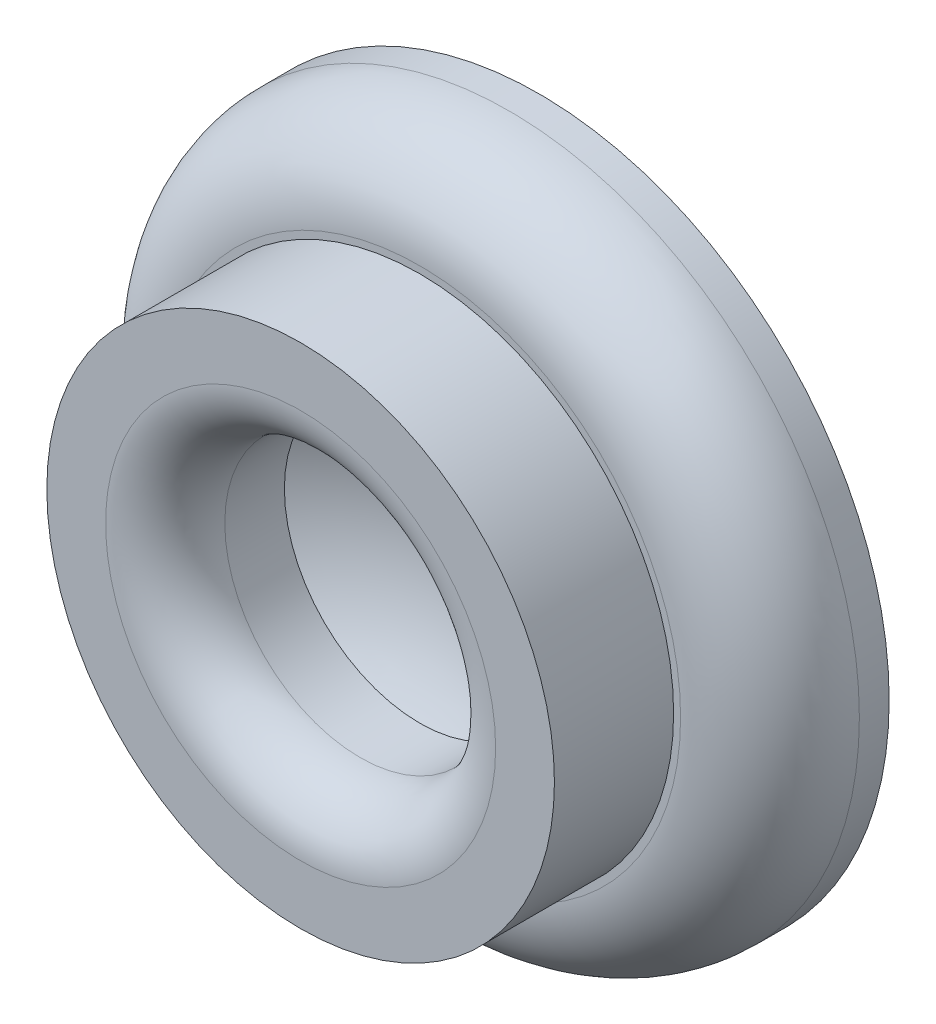
ISO-10303-21;
HEADER;
FILE_DESCRIPTION(('STEP AP214'),'2;1');
FILE_NAME('part.step','',(''),(''),'','','');
FILE_SCHEMA(('AUTOMOTIVE_DESIGN { 1 0 10303 214 1 1 1 1 }'));
ENDSEC;
DATA;
#1=APPLICATION_CONTEXT('core data for automotive mechanical design processes');
#2=APPLICATION_PROTOCOL_DEFINITION('international standard','automotive_design',2000,#1);
#3=PRODUCT_CONTEXT('',#1,'mechanical');
#4=PRODUCT('Part','Part','',(#3));
#5=PRODUCT_RELATED_PRODUCT_CATEGORY('part','',(#4));
#6=PRODUCT_DEFINITION_FORMATION('','',#4);
#7=PRODUCT_DEFINITION_CONTEXT('part definition',#1,'design');
#8=PRODUCT_DEFINITION('design','',#6,#7);
#9=PRODUCT_DEFINITION_SHAPE('','',#8);
#10=(LENGTH_UNIT() NAMED_UNIT(*) SI_UNIT(.MILLI.,.METRE.));
#11=(NAMED_UNIT(*) PLANE_ANGLE_UNIT() SI_UNIT($,.RADIAN.));
#12=(NAMED_UNIT(*) SI_UNIT($,.STERADIAN.) SOLID_ANGLE_UNIT());
#13=UNCERTAINTY_MEASURE_WITH_UNIT(LENGTH_MEASURE(1.E-05),#10,'distance_accuracy_value','');
#14=(GEOMETRIC_REPRESENTATION_CONTEXT(3) GLOBAL_UNCERTAINTY_ASSIGNED_CONTEXT((#13)) GLOBAL_UNIT_ASSIGNED_CONTEXT((#10,
#11,#12)) REPRESENTATION_CONTEXT('',''));
#15=CARTESIAN_POINT('',(0.,0.,0.));
#16=DIRECTION('',(0.,0.,1.));
#17=DIRECTION('',(1.,0.,0.));
#18=AXIS2_PLACEMENT_3D('',#15,#16,#17);
#19=CARTESIAN_POINT('',(0.,0.,6.));
#20=DIRECTION('',(0.,0.,1.));
#21=DIRECTION('',(1.,0.,0.));
#22=AXIS2_PLACEMENT_3D('',#19,#20,#21);
#23=PLANE('',#22);
#24=CARTESIAN_POINT('',(0.,0.,6.));
#25=DIRECTION('',(0.,0.,1.));
#26=DIRECTION('',(1.,0.,0.));
#27=AXIS2_PLACEMENT_3D('',#24,#25,#26);
#28=CIRCLE('',#27,13.1289984889152);
#29=CARTESIAN_POINT('',(13.1289984889152,0.,6.));
#30=VERTEX_POINT('',#29);
#31=EDGE_CURVE('E50',#30,#30,#28,.T.);
#32=ORIENTED_EDGE('',*,*,#31,.T.);
#33=EDGE_LOOP('',(#32));
#34=FACE_BOUND('',#33,.T.);
#35=CARTESIAN_POINT('',(0.,0.,6.));
#36=DIRECTION('',(0.,0.,1.));
#37=DIRECTION('',(1.,0.,0.));
#38=AXIS2_PLACEMENT_3D('',#35,#36,#37);
#39=CIRCLE('',#38,12.777406611752);
#40=CARTESIAN_POINT('',(12.777406611752,0.,6.));
#41=VERTEX_POINT('',#40);
#42=EDGE_CURVE('E57',#41,#41,#39,.T.);
#43=ORIENTED_EDGE('',*,*,#42,.F.);
#44=EDGE_LOOP('',(#43));
#45=FACE_BOUND('',#44,.T.);
#46=ADVANCED_FACE('F33',(#34,#45),#23,.T.);
#47=CARTESIAN_POINT('',(0.,0.,6.));
#48=DIRECTION('',(0.,0.,-1.));
#49=DIRECTION('',(-1.,0.,0.));
#50=AXIS2_PLACEMENT_3D('',#47,#48,#49);
#51=CYLINDRICAL_SURFACE('',#50,17.6289984889152);
#52=CARTESIAN_POINT('',(0.,0.,1.5));
#53=DIRECTION('',(0.,0.,1.));
#54=DIRECTION('',(1.,0.,0.));
#55=AXIS2_PLACEMENT_3D('',#52,#53,#54);
#56=CIRCLE('',#55,17.6289984889152);
#57=CARTESIAN_POINT('',(17.6289984889152,0.,1.5));
#58=VERTEX_POINT('',#57);
#59=EDGE_CURVE('E45',#58,#58,#56,.F.);
#60=ORIENTED_EDGE('',*,*,#59,.T.);
#61=EDGE_LOOP('',(#60));
#62=FACE_BOUND('',#61,.T.);
#63=CARTESIAN_POINT('',(0.,0.,0.));
#64=DIRECTION('',(0.,0.,1.));
#65=DIRECTION('',(1.,0.,0.));
#66=AXIS2_PLACEMENT_3D('',#63,#64,#65);
#67=CIRCLE('',#66,17.6289984889152);
#68=CARTESIAN_POINT('',(17.6289984889152,0.,0.));
#69=VERTEX_POINT('',#68);
#70=EDGE_CURVE('E53',#69,#69,#67,.T.);
#71=ORIENTED_EDGE('',*,*,#70,.T.);
#72=EDGE_LOOP('',(#71));
#73=FACE_BOUND('',#72,.T.);
#74=ADVANCED_FACE('F73',(#62,#73),#51,.T.);
#75=CARTESIAN_POINT('',(0.,0.,0.));
#76=DIRECTION('',(0.,0.,1.));
#77=DIRECTION('',(1.,0.,0.));
#78=AXIS2_PLACEMENT_3D('',#75,#76,#77);
#79=PLANE('',#78);
#80=ORIENTED_EDGE('',*,*,#70,.F.);
#81=EDGE_LOOP('',(#80));
#82=FACE_BOUND('',#81,.T.);
#83=ADVANCED_FACE('F79',(#82),#79,.F.);
#84=CARTESIAN_POINT('',(0.,0.,12.));
#85=DIRECTION('',(0.,0.,1.));
#86=DIRECTION('',(1.,0.,0.));
#87=AXIS2_PLACEMENT_3D('',#84,#85,#86);
#88=PLANE('',#87);
#89=CARTESIAN_POINT('',(0.,0.,12.));
#90=DIRECTION('',(0.,0.,1.));
#91=DIRECTION('',(1.,0.,0.));
#92=AXIS2_PLACEMENT_3D('',#89,#90,#91);
#93=CIRCLE('',#92,9.81823500501302);
#94=CARTESIAN_POINT('',(9.81823500501302,0.,12.));
#95=VERTEX_POINT('',#94);
#96=EDGE_CURVE('E10',#95,#95,#93,.F.);
#97=ORIENTED_EDGE('',*,*,#96,.T.);
#98=EDGE_LOOP('',(#97));
#99=FACE_BOUND('',#98,.T.);
#100=CARTESIAN_POINT('',(0.,0.,12.));
#101=DIRECTION('',(0.,0.,1.));
#102=DIRECTION('',(1.,0.,0.));
#103=AXIS2_PLACEMENT_3D('',#100,#101,#102);
#104=CIRCLE('',#103,12.777406611752);
#105=CARTESIAN_POINT('',(12.777406611752,0.,12.));
#106=VERTEX_POINT('',#105);
#107=EDGE_CURVE('E56',#106,#106,#104,.T.);
#108=ORIENTED_EDGE('',*,*,#107,.T.);
#109=EDGE_LOOP('',(#108));
#110=FACE_BOUND('',#109,.T.);
#111=ADVANCED_FACE('F63',(#99,#110),#88,.T.);
#112=CARTESIAN_POINT('',(0.,0.,12.));
#113=DIRECTION('',(0.,0.,-1.));
#114=DIRECTION('',(-1.,0.,0.));
#115=AXIS2_PLACEMENT_3D('',#112,#113,#114);
#116=CYLINDRICAL_SURFACE('',#115,12.777406611752);
#117=ORIENTED_EDGE('',*,*,#107,.F.);
#118=EDGE_LOOP('',(#117));
#119=FACE_BOUND('',#118,.T.);
#120=ORIENTED_EDGE('',*,*,#42,.T.);
#121=EDGE_LOOP('',(#120));
#122=FACE_BOUND('',#121,.T.);
#123=ADVANCED_FACE('F65',(#119,#122),#116,.T.);
#124=CARTESIAN_POINT('',(0.,0.,12.));
#125=DIRECTION('',(0.,0.,-1.));
#126=DIRECTION('',(-1.,0.,0.));
#127=AXIS2_PLACEMENT_3D('',#124,#125,#126);
#128=CYLINDRICAL_SURFACE('',#127,6.81823500501302);
#129=CARTESIAN_POINT('',(0.,0.,9.));
#130=DIRECTION('',(0.,0.,1.));
#131=DIRECTION('',(1.,0.,0.));
#132=AXIS2_PLACEMENT_3D('',#129,#130,#131);
#133=CIRCLE('',#132,6.81823500501302);
#134=CARTESIAN_POINT('',(6.81823500501302,0.,9.));
#135=VERTEX_POINT('',#134);
#136=EDGE_CURVE('E41',#135,#135,#133,.T.);
#137=ORIENTED_EDGE('',*,*,#136,.T.);
#138=EDGE_LOOP('',(#137));
#139=FACE_BOUND('',#138,.T.);
#140=CARTESIAN_POINT('',(0.,0.,6.));
#141=DIRECTION('',(0.,0.,1.));
#142=DIRECTION('',(1.,0.,0.));
#143=AXIS2_PLACEMENT_3D('',#140,#141,#142);
#144=CIRCLE('',#143,6.81823500501302);
#145=CARTESIAN_POINT('',(6.81823500501302,0.,6.));
#146=VERTEX_POINT('',#145);
#147=EDGE_CURVE('E37',#146,#146,#144,.F.);
#148=ORIENTED_EDGE('',*,*,#147,.T.);
#149=EDGE_LOOP('',(#148));
#150=FACE_BOUND('',#149,.T.);
#151=ADVANCED_FACE('F68',(#139,#150),#128,.F.);
#152=CARTESIAN_POINT('',(0.,0.,16.6220821458962));
#153=DIRECTION('',(0.,0.,1.));
#154=DIRECTION('',(1.,0.,0.));
#155=AXIS2_PLACEMENT_3D('',#152,#153,#154);
#156=SPHERICAL_SURFACE('',#155,12.6220821458962);
#157=ORIENTED_EDGE('',*,*,#147,.F.);
#158=EDGE_LOOP('',(#157));
#159=FACE_BOUND('',#158,.T.);
#160=ADVANCED_FACE('F35',(#159),#156,.F.);
#161=CARTESIAN_POINT('',(0.,0.,1.5));
#162=DIRECTION('',(0.,0.,1.));
#163=DIRECTION('',(1.,0.,0.));
#164=AXIS2_PLACEMENT_3D('',#161,#162,#163);
#165=TOROIDAL_SURFACE('',#164,13.1289984889152,4.5);
#166=ORIENTED_EDGE('',*,*,#59,.F.);
#167=EDGE_LOOP('',(#166));
#168=FACE_BOUND('',#167,.T.);
#169=ORIENTED_EDGE('',*,*,#31,.F.);
#170=EDGE_LOOP('',(#169));
#171=FACE_BOUND('',#170,.T.);
#172=ADVANCED_FACE('F87',(#168,#171),#165,.T.);
#173=CARTESIAN_POINT('',(0.,0.,9.));
#174=DIRECTION('',(0.,0.,1.));
#175=DIRECTION('',(1.,0.,0.));
#176=AXIS2_PLACEMENT_3D('',#173,#174,#175);
#177=TOROIDAL_SURFACE('',#176,9.81823500501302,3.);
#178=ORIENTED_EDGE('',*,*,#96,.F.);
#179=EDGE_LOOP('',(#178));
#180=FACE_BOUND('',#179,.T.);
#181=ORIENTED_EDGE('',*,*,#136,.F.);
#182=EDGE_LOOP('',(#181));
#183=FACE_BOUND('',#182,.T.);
#184=ADVANCED_FACE('F89',(#180,#183),#177,.T.);
#185=CLOSED_SHELL('',(#46,#74,#83,#111,#123,#151,#160,#172,#184));
#186=MANIFOLD_SOLID_BREP('B2',#185);
#187=ADVANCED_BREP_SHAPE_REPRESENTATION('',(#18,#186),#14);
#188=SHAPE_DEFINITION_REPRESENTATION(#9,#187);
ENDSEC;
END-ISO-10303-21;
